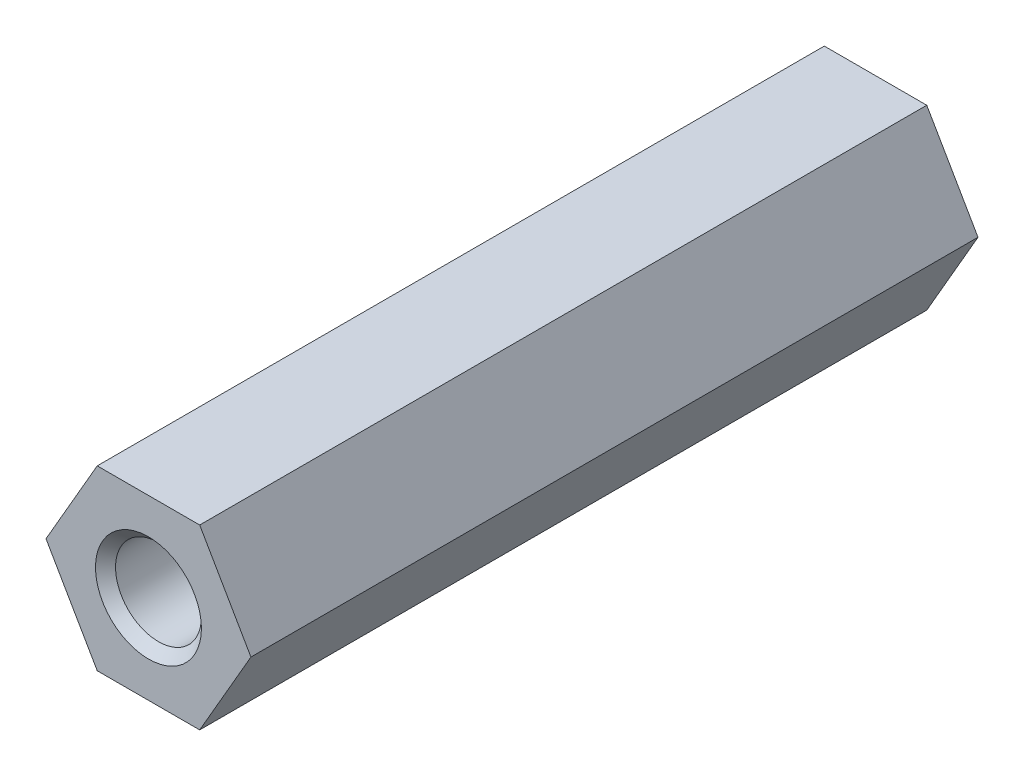
ISO-10303-21;
HEADER;
FILE_DESCRIPTION(('STEP AP214'),'2;1');
FILE_NAME('part.step','',(''),(''),'','','');
FILE_SCHEMA(('AUTOMOTIVE_DESIGN { 1 0 10303 214 1 1 1 1 }'));
ENDSEC;
DATA;
#1=APPLICATION_CONTEXT('core data for automotive mechanical design processes');
#2=APPLICATION_PROTOCOL_DEFINITION('international standard','automotive_design',2000,#1);
#3=PRODUCT_CONTEXT('',#1,'mechanical');
#4=PRODUCT('Part','Part','',(#3));
#5=PRODUCT_RELATED_PRODUCT_CATEGORY('part','',(#4));
#6=PRODUCT_DEFINITION_FORMATION('','',#4);
#7=PRODUCT_DEFINITION_CONTEXT('part definition',#1,'design');
#8=PRODUCT_DEFINITION('design','',#6,#7);
#9=PRODUCT_DEFINITION_SHAPE('','',#8);
#10=(LENGTH_UNIT() NAMED_UNIT(*) SI_UNIT(.MILLI.,.METRE.));
#11=(NAMED_UNIT(*) PLANE_ANGLE_UNIT() SI_UNIT($,.RADIAN.));
#12=(NAMED_UNIT(*) SI_UNIT($,.STERADIAN.) SOLID_ANGLE_UNIT());
#13=UNCERTAINTY_MEASURE_WITH_UNIT(LENGTH_MEASURE(1.E-05),#10,'distance_accuracy_value','');
#14=(GEOMETRIC_REPRESENTATION_CONTEXT(3) GLOBAL_UNCERTAINTY_ASSIGNED_CONTEXT((#13)) GLOBAL_UNIT_ASSIGNED_CONTEXT((#10,
#11,#12)) REPRESENTATION_CONTEXT('',''));
#15=CARTESIAN_POINT('',(0.,0.,0.));
#16=DIRECTION('',(0.,0.,1.));
#17=DIRECTION('',(1.,0.,0.));
#18=AXIS2_PLACEMENT_3D('',#15,#16,#17);
#19=CARTESIAN_POINT('',(-1.78978583448809,3.10000000000005,0.));
#20=DIRECTION('',(-0.866025403784439,0.5,0.));
#21=DIRECTION('',(-0.5,-0.866025403784439,0.));
#22=AXIS2_PLACEMENT_3D('',#19,#20,#21);
#23=PLANE('',#22);
#24=DIRECTION('',(-0.5,-0.866025403784439,0.));
#25=VECTOR('',#24,1.);
#26=CARTESIAN_POINT('',(-1.78978583448809,3.10000000000005,25.4));
#27=LINE('',#26,#25);
#28=CARTESIAN_POINT('',(-1.78978583448809,3.10000000000005,25.4));
#29=VERTEX_POINT('',#28);
#30=CARTESIAN_POINT('',(-3.57957166897597,0.,25.4));
#31=VERTEX_POINT('',#30);
#32=EDGE_CURVE('E121',#29,#31,#27,.T.);
#33=ORIENTED_EDGE('',*,*,#32,.F.);
#34=DIRECTION('',(0.,0.,1.));
#35=VECTOR('',#34,1.);
#36=CARTESIAN_POINT('',(-1.78978583448809,3.10000000000005,0.));
#37=LINE('',#36,#35);
#38=CARTESIAN_POINT('',(-1.78978583448809,3.10000000000005,0.));
#39=VERTEX_POINT('',#38);
#40=EDGE_CURVE('E50',#39,#29,#37,.T.);
#41=ORIENTED_EDGE('',*,*,#40,.F.);
#42=DIRECTION('',(-0.5,-0.866025403784439,0.));
#43=VECTOR('',#42,1.);
#44=CARTESIAN_POINT('',(-1.78978583448809,3.10000000000005,0.));
#45=LINE('',#44,#43);
#46=CARTESIAN_POINT('',(-3.57957166897597,0.,0.));
#47=VERTEX_POINT('',#46);
#48=EDGE_CURVE('E136',#39,#47,#45,.T.);
#49=ORIENTED_EDGE('',*,*,#48,.T.);
#50=DIRECTION('',(0.,0.,1.));
#51=VECTOR('',#50,1.);
#52=CARTESIAN_POINT('',(-3.57957166897597,0.,0.));
#53=LINE('',#52,#51);
#54=EDGE_CURVE('E85',#47,#31,#53,.T.);
#55=ORIENTED_EDGE('',*,*,#54,.T.);
#56=EDGE_LOOP('',(#33,#41,#49,#55));
#57=FACE_BOUND('',#56,.T.);
#58=ADVANCED_FACE('F33',(#57),#23,.T.);
#59=CARTESIAN_POINT('',(1.78978583448794,3.10000000000005,0.));
#60=DIRECTION('',(0.,1.,0.));
#61=DIRECTION('',(-1.,0.,0.));
#62=AXIS2_PLACEMENT_3D('',#59,#60,#61);
#63=PLANE('',#62);
#64=DIRECTION('',(-1.,0.,0.));
#65=VECTOR('',#64,1.);
#66=CARTESIAN_POINT('',(1.78978583448794,3.10000000000005,25.4));
#67=LINE('',#66,#65);
#68=CARTESIAN_POINT('',(1.78978583448794,3.10000000000005,25.4));
#69=VERTEX_POINT('',#68);
#70=EDGE_CURVE('E133',#69,#29,#67,.T.);
#71=ORIENTED_EDGE('',*,*,#70,.F.);
#72=DIRECTION('',(0.,0.,1.));
#73=VECTOR('',#72,1.);
#74=CARTESIAN_POINT('',(1.78978583448794,3.10000000000005,0.));
#75=LINE('',#74,#73);
#76=CARTESIAN_POINT('',(1.78978583448794,3.10000000000005,0.));
#77=VERTEX_POINT('',#76);
#78=EDGE_CURVE('E73',#77,#69,#75,.T.);
#79=ORIENTED_EDGE('',*,*,#78,.F.);
#80=DIRECTION('',(-1.,0.,0.));
#81=VECTOR('',#80,1.);
#82=CARTESIAN_POINT('',(1.78978583448794,3.10000000000005,0.));
#83=LINE('',#82,#81);
#84=EDGE_CURVE('E111',#77,#39,#83,.T.);
#85=ORIENTED_EDGE('',*,*,#84,.T.);
#86=ORIENTED_EDGE('',*,*,#40,.T.);
#87=EDGE_LOOP('',(#71,#79,#85,#86));
#88=FACE_BOUND('',#87,.T.);
#89=ADVANCED_FACE('F173',(#88),#63,.T.);
#90=CARTESIAN_POINT('',(3.57957166897581,0.,0.));
#91=DIRECTION('',(0.866025403784439,0.5,0.));
#92=DIRECTION('',(-0.5,0.866025403784439,0.));
#93=AXIS2_PLACEMENT_3D('',#90,#91,#92);
#94=PLANE('',#93);
#95=DIRECTION('',(-0.5,0.866025403784439,0.));
#96=VECTOR('',#95,1.);
#97=CARTESIAN_POINT('',(3.57957166897581,0.,25.4));
#98=LINE('',#97,#96);
#99=CARTESIAN_POINT('',(3.57957166897581,0.,25.4));
#100=VERTEX_POINT('',#99);
#101=EDGE_CURVE('E98',#100,#69,#98,.T.);
#102=ORIENTED_EDGE('',*,*,#101,.F.);
#103=DIRECTION('',(0.,0.,1.));
#104=VECTOR('',#103,1.);
#105=CARTESIAN_POINT('',(3.57957166897581,0.,0.));
#106=LINE('',#105,#104);
#107=CARTESIAN_POINT('',(3.57957166897581,0.,0.));
#108=VERTEX_POINT('',#107);
#109=EDGE_CURVE('E93',#108,#100,#106,.T.);
#110=ORIENTED_EDGE('',*,*,#109,.F.);
#111=DIRECTION('',(-0.5,0.866025403784439,0.));
#112=VECTOR('',#111,1.);
#113=CARTESIAN_POINT('',(3.57957166897581,0.,0.));
#114=LINE('',#113,#112);
#115=EDGE_CURVE('E96',#108,#77,#114,.T.);
#116=ORIENTED_EDGE('',*,*,#115,.T.);
#117=ORIENTED_EDGE('',*,*,#78,.T.);
#118=EDGE_LOOP('',(#102,#110,#116,#117));
#119=FACE_BOUND('',#118,.T.);
#120=ADVANCED_FACE('F95',(#119),#94,.T.);
#121=CARTESIAN_POINT('',(1.78978583448792,-3.10000000000006,0.));
#122=DIRECTION('',(0.866025403784439,-0.5,0.));
#123=DIRECTION('',(0.5,0.866025403784439,0.));
#124=AXIS2_PLACEMENT_3D('',#121,#122,#123);
#125=PLANE('',#124);
#126=DIRECTION('',(0.5,0.866025403784439,0.));
#127=VECTOR('',#126,1.);
#128=CARTESIAN_POINT('',(1.78978583448792,-3.10000000000006,25.4));
#129=LINE('',#128,#127);
#130=CARTESIAN_POINT('',(1.78978583448792,-3.10000000000006,25.4));
#131=VERTEX_POINT('',#130);
#132=EDGE_CURVE('E130',#131,#100,#129,.T.);
#133=ORIENTED_EDGE('',*,*,#132,.F.);
#134=DIRECTION('',(0.,0.,1.));
#135=VECTOR('',#134,1.);
#136=CARTESIAN_POINT('',(1.78978583448792,-3.10000000000006,0.));
#137=LINE('',#136,#135);
#138=CARTESIAN_POINT('',(1.78978583448792,-3.10000000000006,0.));
#139=VERTEX_POINT('',#138);
#140=EDGE_CURVE('E103',#139,#131,#137,.T.);
#141=ORIENTED_EDGE('',*,*,#140,.F.);
#142=DIRECTION('',(0.5,0.866025403784439,0.));
#143=VECTOR('',#142,1.);
#144=CARTESIAN_POINT('',(1.78978583448792,-3.10000000000006,0.));
#145=LINE('',#144,#143);
#146=EDGE_CURVE('E109',#139,#108,#145,.T.);
#147=ORIENTED_EDGE('',*,*,#146,.T.);
#148=ORIENTED_EDGE('',*,*,#109,.T.);
#149=EDGE_LOOP('',(#133,#141,#147,#148));
#150=FACE_BOUND('',#149,.T.);
#151=ADVANCED_FACE('F113',(#150),#125,.T.);
#152=CARTESIAN_POINT('',(-1.78978583448811,-3.10000000000006,0.));
#153=DIRECTION('',(0.,-1.,0.));
#154=DIRECTION('',(0.,0.,-1.));
#155=AXIS2_PLACEMENT_3D('',#152,#153,#154);
#156=PLANE('',#155);
#157=DIRECTION('',(1.,0.,0.));
#158=VECTOR('',#157,1.);
#159=CARTESIAN_POINT('',(-1.78978583448811,-3.10000000000006,25.4));
#160=LINE('',#159,#158);
#161=CARTESIAN_POINT('',(-1.78978583448811,-3.10000000000006,25.4));
#162=VERTEX_POINT('',#161);
#163=EDGE_CURVE('E127',#162,#131,#160,.T.);
#164=ORIENTED_EDGE('',*,*,#163,.F.);
#165=DIRECTION('',(0.,0.,1.));
#166=VECTOR('',#165,1.);
#167=CARTESIAN_POINT('',(-1.78978583448811,-3.10000000000006,0.));
#168=LINE('',#167,#166);
#169=CARTESIAN_POINT('',(-1.78978583448811,-3.10000000000006,0.));
#170=VERTEX_POINT('',#169);
#171=EDGE_CURVE('E141',#170,#162,#168,.T.);
#172=ORIENTED_EDGE('',*,*,#171,.F.);
#173=DIRECTION('',(1.,0.,0.));
#174=VECTOR('',#173,1.);
#175=CARTESIAN_POINT('',(-1.78978583448811,-3.10000000000006,0.));
#176=LINE('',#175,#174);
#177=EDGE_CURVE('E114',#170,#139,#176,.T.);
#178=ORIENTED_EDGE('',*,*,#177,.T.);
#179=ORIENTED_EDGE('',*,*,#140,.T.);
#180=EDGE_LOOP('',(#164,#172,#178,#179));
#181=FACE_BOUND('',#180,.T.);
#182=ADVANCED_FACE('F169',(#181),#156,.T.);
#183=CARTESIAN_POINT('',(-3.57957166897597,0.,0.));
#184=DIRECTION('',(-0.866025403784439,-0.5,0.));
#185=DIRECTION('',(0.5,-0.866025403784439,0.));
#186=AXIS2_PLACEMENT_3D('',#183,#184,#185);
#187=PLANE('',#186);
#188=DIRECTION('',(0.5,-0.866025403784439,0.));
#189=VECTOR('',#188,1.);
#190=CARTESIAN_POINT('',(-3.57957166897597,0.,25.4));
#191=LINE('',#190,#189);
#192=EDGE_CURVE('E124',#31,#162,#191,.T.);
#193=ORIENTED_EDGE('',*,*,#192,.F.);
#194=ORIENTED_EDGE('',*,*,#54,.F.);
#195=DIRECTION('',(0.5,-0.866025403784439,0.));
#196=VECTOR('',#195,1.);
#197=CARTESIAN_POINT('',(-3.57957166897597,0.,0.));
#198=LINE('',#197,#196);
#199=EDGE_CURVE('E116',#47,#170,#198,.T.);
#200=ORIENTED_EDGE('',*,*,#199,.T.);
#201=ORIENTED_EDGE('',*,*,#171,.T.);
#202=EDGE_LOOP('',(#193,#194,#200,#201));
#203=FACE_BOUND('',#202,.T.);
#204=ADVANCED_FACE('F161',(#203),#187,.T.);
#205=CARTESIAN_POINT('',(0.,0.,0.));
#206=DIRECTION('',(0.,0.,1.));
#207=DIRECTION('',(1.,0.,0.));
#208=AXIS2_PLACEMENT_3D('',#205,#206,#207);
#209=PLANE('',#208);
#210=CARTESIAN_POINT('',(0.,0.,0.));
#211=DIRECTION('',(0.,0.,1.));
#212=DIRECTION('',(1.,0.,0.));
#213=AXIS2_PLACEMENT_3D('',#210,#211,#212);
#214=CIRCLE('',#213,1.84999999999043);
#215=CARTESIAN_POINT('',(1.84999999999043,0.,0.));
#216=VERTEX_POINT('',#215);
#217=EDGE_CURVE('E138',#216,#216,#214,.T.);
#218=ORIENTED_EDGE('',*,*,#217,.T.);
#219=EDGE_LOOP('',(#218));
#220=FACE_BOUND('',#219,.T.);
#221=ORIENTED_EDGE('',*,*,#48,.F.);
#222=ORIENTED_EDGE('',*,*,#84,.F.);
#223=ORIENTED_EDGE('',*,*,#115,.F.);
#224=ORIENTED_EDGE('',*,*,#146,.F.);
#225=ORIENTED_EDGE('',*,*,#177,.F.);
#226=ORIENTED_EDGE('',*,*,#199,.F.);
#227=EDGE_LOOP('',(#221,#222,#223,#224,#225,#226));
#228=FACE_BOUND('',#227,.T.);
#229=ADVANCED_FACE('F107',(#220,#228),#209,.F.);
#230=CARTESIAN_POINT('',(0.,0.,25.4));
#231=DIRECTION('',(0.,0.,1.));
#232=DIRECTION('',(1.,0.,0.));
#233=AXIS2_PLACEMENT_3D('',#230,#231,#232);
#234=PLANE('',#233);
#235=CARTESIAN_POINT('',(0.,0.,25.4));
#236=DIRECTION('',(0.,0.,1.));
#237=DIRECTION('',(1.,0.,0.));
#238=AXIS2_PLACEMENT_3D('',#235,#236,#237);
#239=CIRCLE('',#238,1.84999999999044);
#240=CARTESIAN_POINT('',(1.84999999999044,0.,25.4));
#241=VERTEX_POINT('',#240);
#242=EDGE_CURVE('E11',#241,#241,#239,.F.);
#243=ORIENTED_EDGE('',*,*,#242,.T.);
#244=EDGE_LOOP('',(#243));
#245=FACE_BOUND('',#244,.T.);
#246=ORIENTED_EDGE('',*,*,#32,.T.);
#247=ORIENTED_EDGE('',*,*,#192,.T.);
#248=ORIENTED_EDGE('',*,*,#163,.T.);
#249=ORIENTED_EDGE('',*,*,#132,.T.);
#250=ORIENTED_EDGE('',*,*,#101,.T.);
#251=ORIENTED_EDGE('',*,*,#70,.T.);
#252=EDGE_LOOP('',(#246,#247,#248,#249,#250,#251));
#253=FACE_BOUND('',#252,.T.);
#254=ADVANCED_FACE('F160',(#245,#253),#234,.T.);
#255=CARTESIAN_POINT('',(0.,0.,25.4));
#256=DIRECTION('',(0.,0.,1.));
#257=DIRECTION('',(1.,0.,0.));
#258=AXIS2_PLACEMENT_3D('',#255,#256,#257);
#259=CYLINDRICAL_SURFACE('',#258,1.49999999999999);
#260=CARTESIAN_POINT('',(0.,0.,0.349999999990445));
#261=DIRECTION('',(0.,0.,1.));
#262=DIRECTION('',(1.,0.,0.));
#263=AXIS2_PLACEMENT_3D('',#260,#261,#262);
#264=CIRCLE('',#263,1.49999999999999);
#265=CARTESIAN_POINT('',(1.49999999999999,0.,0.349999999990445));
#266=VERTEX_POINT('',#265);
#267=EDGE_CURVE('E42',#266,#266,#264,.F.);
#268=ORIENTED_EDGE('',*,*,#267,.T.);
#269=EDGE_LOOP('',(#268));
#270=FACE_BOUND('',#269,.T.);
#271=CARTESIAN_POINT('',(0.,0.,25.0500000000095));
#272=DIRECTION('',(0.,0.,1.));
#273=DIRECTION('',(1.,0.,0.));
#274=AXIS2_PLACEMENT_3D('',#271,#272,#273);
#275=CIRCLE('',#274,1.49999999999999);
#276=CARTESIAN_POINT('',(1.49999999999999,0.,25.0500000000095));
#277=VERTEX_POINT('',#276);
#278=EDGE_CURVE('E146',#277,#277,#275,.T.);
#279=ORIENTED_EDGE('',*,*,#278,.T.);
#280=EDGE_LOOP('',(#279));
#281=FACE_BOUND('',#280,.T.);
#282=ADVANCED_FACE('F151',(#270,#281),#259,.F.);
#283=CARTESIAN_POINT('',(0.,0.,0.));
#284=DIRECTION('',(0.,0.,-1.));
#285=DIRECTION('',(-1.,0.,0.));
#286=AXIS2_PLACEMENT_3D('',#283,#284,#285);
#287=CONICAL_SURFACE('',#286,1.84999999999043,0.785398163397446);
#288=ORIENTED_EDGE('',*,*,#267,.F.);
#289=EDGE_LOOP('',(#288));
#290=FACE_BOUND('',#289,.T.);
#291=ORIENTED_EDGE('',*,*,#217,.F.);
#292=EDGE_LOOP('',(#291));
#293=FACE_BOUND('',#292,.T.);
#294=ADVANCED_FACE('F154',(#290,#293),#287,.F.);
#295=CARTESIAN_POINT('',(0.,0.,25.0500000000095));
#296=DIRECTION('',(0.,0.,1.));
#297=DIRECTION('',(1.,0.,0.));
#298=AXIS2_PLACEMENT_3D('',#295,#296,#297);
#299=CONICAL_SURFACE('',#298,1.49999999999999,0.785398163397441);
#300=ORIENTED_EDGE('',*,*,#242,.F.);
#301=EDGE_LOOP('',(#300));
#302=FACE_BOUND('',#301,.T.);
#303=ORIENTED_EDGE('',*,*,#278,.F.);
#304=EDGE_LOOP('',(#303));
#305=FACE_BOUND('',#304,.T.);
#306=ADVANCED_FACE('F35',(#302,#305),#299,.F.);
#307=CLOSED_SHELL('',(#58,#89,#120,#151,#182,#204,#229,#254,#282,#294,#306));
#308=MANIFOLD_SOLID_BREP('B2',#307);
#309=ADVANCED_BREP_SHAPE_REPRESENTATION('',(#18,#308),#14);
#310=SHAPE_DEFINITION_REPRESENTATION(#9,#309);
ENDSEC;
END-ISO-10303-21;
